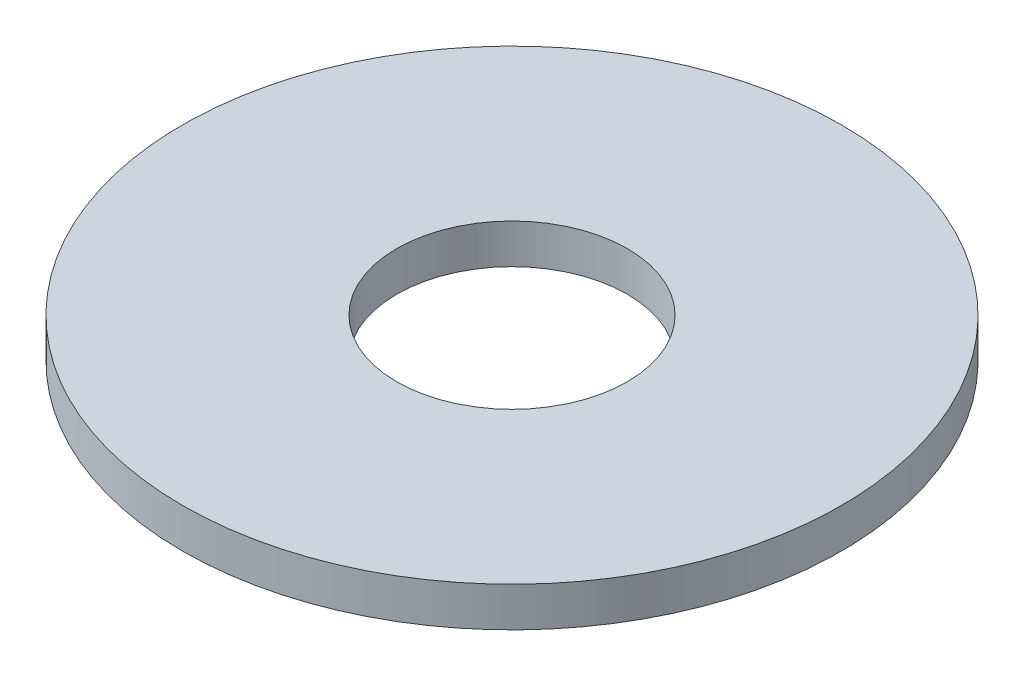
ISO-10303-21;
HEADER;
FILE_DESCRIPTION(('STEP AP214'),'2;1');
FILE_NAME('part.step','',(''),(''),'','','');
FILE_SCHEMA(('AUTOMOTIVE_DESIGN { 1 0 10303 214 1 1 1 1 }'));
ENDSEC;
DATA;
#1=APPLICATION_CONTEXT('core data for automotive mechanical design processes');
#2=APPLICATION_PROTOCOL_DEFINITION('international standard','automotive_design',2000,#1);
#3=PRODUCT_CONTEXT('',#1,'mechanical');
#4=PRODUCT('Part','Part','',(#3));
#5=PRODUCT_RELATED_PRODUCT_CATEGORY('part','',(#4));
#6=PRODUCT_DEFINITION_FORMATION('','',#4);
#7=PRODUCT_DEFINITION_CONTEXT('part definition',#1,'design');
#8=PRODUCT_DEFINITION('design','',#6,#7);
#9=PRODUCT_DEFINITION_SHAPE('','',#8);
#10=(LENGTH_UNIT() NAMED_UNIT(*) SI_UNIT(.MILLI.,.METRE.));
#11=(NAMED_UNIT(*) PLANE_ANGLE_UNIT() SI_UNIT($,.RADIAN.));
#12=(NAMED_UNIT(*) SI_UNIT($,.STERADIAN.) SOLID_ANGLE_UNIT());
#13=UNCERTAINTY_MEASURE_WITH_UNIT(LENGTH_MEASURE(1.E-05),#10,'distance_accuracy_value','');
#14=(GEOMETRIC_REPRESENTATION_CONTEXT(3) GLOBAL_UNCERTAINTY_ASSIGNED_CONTEXT((#13)) GLOBAL_UNIT_ASSIGNED_CONTEXT((#10,
#11,#12)) REPRESENTATION_CONTEXT('',''));
#15=CARTESIAN_POINT('',(0.,0.,0.));
#16=DIRECTION('',(0.,0.,1.));
#17=DIRECTION('',(1.,0.,0.));
#18=AXIS2_PLACEMENT_3D('',#15,#16,#17);
#19=CARTESIAN_POINT('',(0.,12.,0.));
#20=DIRECTION('',(0.,-1.,0.));
#21=DIRECTION('',(0.,0.,-1.));
#22=AXIS2_PLACEMENT_3D('',#19,#20,#21);
#23=CYLINDRICAL_SURFACE('',#22,100.);
#24=CARTESIAN_POINT('',(0.,12.,0.));
#25=DIRECTION('',(0.,1.,0.));
#26=DIRECTION('',(0.,0.,1.));
#27=AXIS2_PLACEMENT_3D('',#24,#25,#26);
#28=CIRCLE('',#27,100.);
#29=CARTESIAN_POINT('',(0.,12.,100.));
#30=VERTEX_POINT('',#29);
#31=EDGE_CURVE('E10',#30,#30,#28,.T.);
#32=ORIENTED_EDGE('',*,*,#31,.F.);
#33=EDGE_LOOP('',(#32));
#34=FACE_BOUND('',#33,.T.);
#35=CARTESIAN_POINT('',(0.,0.,0.));
#36=DIRECTION('',(0.,1.,0.));
#37=DIRECTION('',(0.,0.,1.));
#38=AXIS2_PLACEMENT_3D('',#35,#36,#37);
#39=CIRCLE('',#38,100.);
#40=CARTESIAN_POINT('',(0.,0.,100.));
#41=VERTEX_POINT('',#40);
#42=EDGE_CURVE('E37',#41,#41,#39,.T.);
#43=ORIENTED_EDGE('',*,*,#42,.T.);
#44=EDGE_LOOP('',(#43));
#45=FACE_BOUND('',#44,.T.);
#46=ADVANCED_FACE('F40',(#34,#45),#23,.T.);
#47=CARTESIAN_POINT('',(0.,12.,0.));
#48=DIRECTION('',(0.,1.,0.));
#49=DIRECTION('',(0.,0.,1.));
#50=AXIS2_PLACEMENT_3D('',#47,#48,#49);
#51=PLANE('',#50);
#52=CARTESIAN_POINT('',(0.,12.,0.));
#53=DIRECTION('',(0.,1.,0.));
#54=DIRECTION('',(0.,0.,1.));
#55=AXIS2_PLACEMENT_3D('',#52,#53,#54);
#56=CIRCLE('',#55,35.);
#57=CARTESIAN_POINT('',(0.,12.,35.));
#58=VERTEX_POINT('',#57);
#59=EDGE_CURVE('E50',#58,#58,#56,.T.);
#60=ORIENTED_EDGE('',*,*,#59,.F.);
#61=EDGE_LOOP('',(#60));
#62=FACE_BOUND('',#61,.T.);
#63=ORIENTED_EDGE('',*,*,#31,.T.);
#64=EDGE_LOOP('',(#63));
#65=FACE_BOUND('',#64,.T.);
#66=ADVANCED_FACE('F59',(#62,#65),#51,.T.);
#67=CARTESIAN_POINT('',(0.,0.,0.));
#68=DIRECTION('',(0.,1.,0.));
#69=DIRECTION('',(0.,0.,1.));
#70=AXIS2_PLACEMENT_3D('',#67,#68,#69);
#71=PLANE('',#70);
#72=CARTESIAN_POINT('',(0.,0.,0.));
#73=DIRECTION('',(0.,1.,0.));
#74=DIRECTION('',(0.,0.,1.));
#75=AXIS2_PLACEMENT_3D('',#72,#73,#74);
#76=CIRCLE('',#75,35.);
#77=CARTESIAN_POINT('',(0.,0.,35.));
#78=VERTEX_POINT('',#77);
#79=EDGE_CURVE('E47',#78,#78,#76,.T.);
#80=ORIENTED_EDGE('',*,*,#79,.T.);
#81=EDGE_LOOP('',(#80));
#82=FACE_BOUND('',#81,.T.);
#83=ORIENTED_EDGE('',*,*,#42,.F.);
#84=EDGE_LOOP('',(#83));
#85=FACE_BOUND('',#84,.T.);
#86=ADVANCED_FACE('F58',(#82,#85),#71,.F.);
#87=CARTESIAN_POINT('',(0.,12.,0.));
#88=DIRECTION('',(0.,-1.,0.));
#89=DIRECTION('',(0.,0.,-1.));
#90=AXIS2_PLACEMENT_3D('',#87,#88,#89);
#91=CYLINDRICAL_SURFACE('',#90,35.);
#92=ORIENTED_EDGE('',*,*,#59,.T.);
#93=EDGE_LOOP('',(#92));
#94=FACE_BOUND('',#93,.T.);
#95=ORIENTED_EDGE('',*,*,#79,.F.);
#96=EDGE_LOOP('',(#95));
#97=FACE_BOUND('',#96,.T.);
#98=ADVANCED_FACE('F54',(#94,#97),#91,.F.);
#99=CLOSED_SHELL('',(#46,#66,#86,#98));
#100=MANIFOLD_SOLID_BREP('B2',#99);
#101=ADVANCED_BREP_SHAPE_REPRESENTATION('',(#18,#100),#14);
#102=SHAPE_DEFINITION_REPRESENTATION(#9,#101);
ENDSEC;
END-ISO-10303-21;
